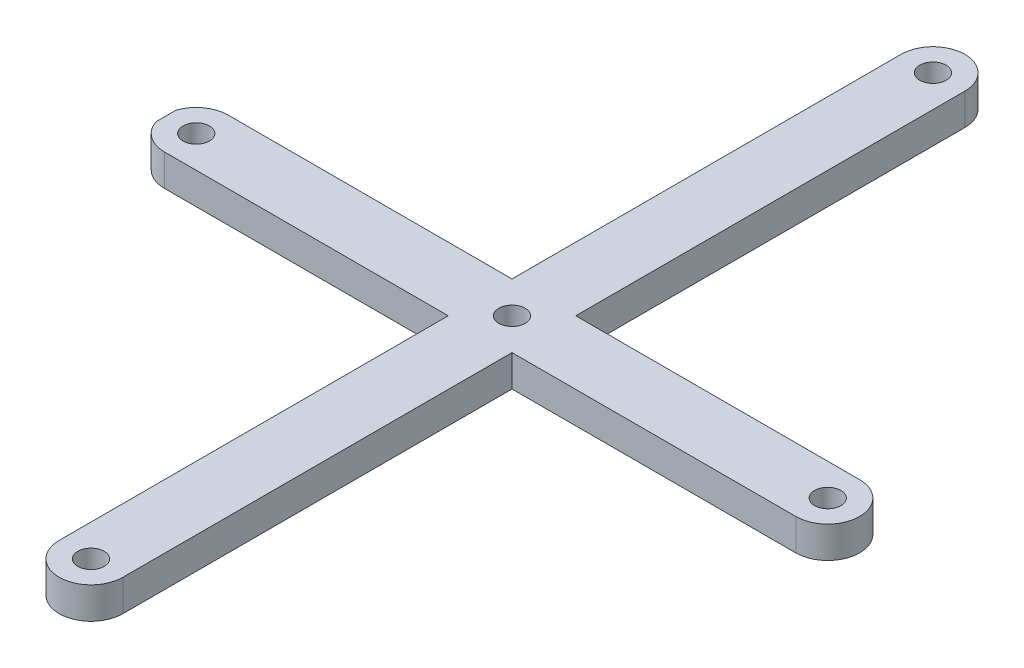
ISO-10303-21;
HEADER;
FILE_DESCRIPTION(('STEP AP214'),'2;1');
FILE_NAME('part.step','',(''),(''),'','','');
FILE_SCHEMA(('AUTOMOTIVE_DESIGN { 1 0 10303 214 1 1 1 1 }'));
ENDSEC;
DATA;
#1=APPLICATION_CONTEXT('core data for automotive mechanical design processes');
#2=APPLICATION_PROTOCOL_DEFINITION('international standard','automotive_design',2000,#1);
#3=PRODUCT_CONTEXT('',#1,'mechanical');
#4=PRODUCT('Part','Part','',(#3));
#5=PRODUCT_RELATED_PRODUCT_CATEGORY('part','',(#4));
#6=PRODUCT_DEFINITION_FORMATION('','',#4);
#7=PRODUCT_DEFINITION_CONTEXT('part definition',#1,'design');
#8=PRODUCT_DEFINITION('design','',#6,#7);
#9=PRODUCT_DEFINITION_SHAPE('','',#8);
#10=(LENGTH_UNIT() NAMED_UNIT(*) SI_UNIT(.MILLI.,.METRE.));
#11=(NAMED_UNIT(*) PLANE_ANGLE_UNIT() SI_UNIT($,.RADIAN.));
#12=(NAMED_UNIT(*) SI_UNIT($,.STERADIAN.) SOLID_ANGLE_UNIT());
#13=UNCERTAINTY_MEASURE_WITH_UNIT(LENGTH_MEASURE(1.E-05),#10,'distance_accuracy_value','');
#14=(GEOMETRIC_REPRESENTATION_CONTEXT(3) GLOBAL_UNCERTAINTY_ASSIGNED_CONTEXT((#13)) GLOBAL_UNIT_ASSIGNED_CONTEXT((#10,
#11,#12)) REPRESENTATION_CONTEXT('',''));
#15=CARTESIAN_POINT('',(0.,0.,0.));
#16=DIRECTION('',(0.,0.,1.));
#17=DIRECTION('',(1.,0.,0.));
#18=AXIS2_PLACEMENT_3D('',#15,#16,#17);
#19=CARTESIAN_POINT('',(0.,0.6,-3.42424242424242));
#20=DIRECTION('',(0.,0.,1.));
#21=DIRECTION('',(1.,0.,0.));
#22=AXIS2_PLACEMENT_3D('',#19,#20,#21);
#23=PLANE('',#22);
#24=DIRECTION('',(-1.,0.,0.));
#25=VECTOR('',#24,1.);
#26=CARTESIAN_POINT('',(0.,0.,-3.42424242424242));
#27=LINE('',#26,#25);
#28=CARTESIAN_POINT('',(7.84848484848485,0.,-3.42424242424242));
#29=VERTEX_POINT('',#28);
#30=CARTESIAN_POINT('',(2.45454545454545,0.,-3.42424242424242));
#31=VERTEX_POINT('',#30);
#32=EDGE_CURVE('E197',#29,#31,#27,.T.);
#33=ORIENTED_EDGE('',*,*,#32,.T.);
#34=DIRECTION('',(0.,-1.,0.));
#35=VECTOR('',#34,1.);
#36=CARTESIAN_POINT('',(2.45454545454545,0.6,-3.42424242424242));
#37=LINE('',#36,#35);
#38=CARTESIAN_POINT('',(2.45454545454545,0.6,-3.42424242424242));
#39=VERTEX_POINT('',#38);
#40=EDGE_CURVE('E11',#39,#31,#37,.T.);
#41=ORIENTED_EDGE('',*,*,#40,.F.);
#42=DIRECTION('',(-1.,0.,0.));
#43=VECTOR('',#42,1.);
#44=CARTESIAN_POINT('',(0.,0.6,-3.42424242424242));
#45=LINE('',#44,#43);
#46=CARTESIAN_POINT('',(7.84848484848485,0.6,-3.42424242424242));
#47=VERTEX_POINT('',#46);
#48=EDGE_CURVE('E115',#47,#39,#45,.T.);
#49=ORIENTED_EDGE('',*,*,#48,.F.);
#50=DIRECTION('',(0.,-1.,0.));
#51=VECTOR('',#50,1.);
#52=CARTESIAN_POINT('',(7.84848484848485,0.6,-3.42424242424242));
#53=LINE('',#52,#51);
#54=EDGE_CURVE('E59',#47,#29,#53,.T.);
#55=ORIENTED_EDGE('',*,*,#54,.T.);
#56=EDGE_LOOP('',(#33,#41,#49,#55));
#57=FACE_BOUND('',#56,.T.);
#58=ADVANCED_FACE('F41',(#57),#23,.F.);
#59=CARTESIAN_POINT('',(2.45454545454545,0.6,0.));
#60=DIRECTION('',(1.,0.,0.));
#61=DIRECTION('',(0.,0.,-1.));
#62=AXIS2_PLACEMENT_3D('',#59,#60,#61);
#63=PLANE('',#62);
#64=DIRECTION('',(0.,0.,1.));
#65=VECTOR('',#64,1.);
#66=CARTESIAN_POINT('',(2.45454545454545,0.,0.));
#67=LINE('',#66,#65);
#68=CARTESIAN_POINT('',(2.45454545454545,0.,-10.8181818181818));
#69=VERTEX_POINT('',#68);
#70=EDGE_CURVE('E200',#69,#31,#67,.T.);
#71=ORIENTED_EDGE('',*,*,#70,.F.);
#72=DIRECTION('',(0.,-1.,0.));
#73=VECTOR('',#72,1.);
#74=CARTESIAN_POINT('',(2.45454545454545,0.6,-10.8181818181818));
#75=LINE('',#74,#73);
#76=CARTESIAN_POINT('',(2.45454545454545,0.6,-10.8181818181818));
#77=VERTEX_POINT('',#76);
#78=EDGE_CURVE('E51',#77,#69,#75,.T.);
#79=ORIENTED_EDGE('',*,*,#78,.F.);
#80=DIRECTION('',(0.,0.,1.));
#81=VECTOR('',#80,1.);
#82=CARTESIAN_POINT('',(2.45454545454545,0.6,0.));
#83=LINE('',#82,#81);
#84=EDGE_CURVE('E312',#77,#39,#83,.T.);
#85=ORIENTED_EDGE('',*,*,#84,.T.);
#86=ORIENTED_EDGE('',*,*,#40,.T.);
#87=EDGE_LOOP('',(#71,#79,#85,#86));
#88=FACE_BOUND('',#87,.T.);
#89=ADVANCED_FACE('F43',(#88),#63,.T.);
#90=CARTESIAN_POINT('',(1.84848484848485,0.6,-10.8181818181818));
#91=DIRECTION('',(0.,-1.,0.));
#92=DIRECTION('',(0.,0.,-1.));
#93=AXIS2_PLACEMENT_3D('',#90,#91,#92);
#94=CYLINDRICAL_SURFACE('',#93,0.606060606060602);
#95=CARTESIAN_POINT('',(1.84848484848485,0.,-10.8181818181818));
#96=DIRECTION('',(0.,1.,0.));
#97=DIRECTION('',(0.,0.,1.));
#98=AXIS2_PLACEMENT_3D('',#95,#96,#97);
#99=CIRCLE('',#98,0.606060606060602);
#100=CARTESIAN_POINT('',(1.24242424242425,0.,-10.8181818181818));
#101=VERTEX_POINT('',#100);
#102=EDGE_CURVE('E206',#101,#69,#99,.F.);
#103=ORIENTED_EDGE('',*,*,#102,.F.);
#104=DIRECTION('',(0.,-1.,0.));
#105=VECTOR('',#104,1.);
#106=CARTESIAN_POINT('',(1.24242424242425,0.6,-10.8181818181818));
#107=LINE('',#106,#105);
#108=CARTESIAN_POINT('',(1.24242424242425,0.6,-10.8181818181818));
#109=VERTEX_POINT('',#108);
#110=EDGE_CURVE('E288',#109,#101,#107,.T.);
#111=ORIENTED_EDGE('',*,*,#110,.F.);
#112=CARTESIAN_POINT('',(1.84848484848485,0.6,-10.8181818181818));
#113=DIRECTION('',(0.,1.,0.));
#114=DIRECTION('',(0.,0.,1.));
#115=AXIS2_PLACEMENT_3D('',#112,#113,#114);
#116=CIRCLE('',#115,0.606060606060602);
#117=EDGE_CURVE('E297',#109,#77,#116,.F.);
#118=ORIENTED_EDGE('',*,*,#117,.T.);
#119=ORIENTED_EDGE('',*,*,#78,.T.);
#120=EDGE_LOOP('',(#103,#111,#118,#119));
#121=FACE_BOUND('',#120,.T.);
#122=ADVANCED_FACE('F295',(#121),#94,.T.);
#123=CARTESIAN_POINT('',(1.24242424242425,0.6,0.));
#124=DIRECTION('',(-1.,0.,0.));
#125=DIRECTION('',(0.,0.,1.));
#126=AXIS2_PLACEMENT_3D('',#123,#124,#125);
#127=PLANE('',#126);
#128=DIRECTION('',(0.,0.,-1.));
#129=VECTOR('',#128,1.);
#130=CARTESIAN_POINT('',(1.24242424242425,0.,0.));
#131=LINE('',#130,#129);
#132=CARTESIAN_POINT('',(1.24242424242425,0.,-3.42424242424242));
#133=VERTEX_POINT('',#132);
#134=EDGE_CURVE('E210',#133,#101,#131,.T.);
#135=ORIENTED_EDGE('',*,*,#134,.F.);
#136=DIRECTION('',(0.,-1.,0.));
#137=VECTOR('',#136,1.);
#138=CARTESIAN_POINT('',(1.24242424242425,0.6,-3.42424242424242));
#139=LINE('',#138,#137);
#140=CARTESIAN_POINT('',(1.24242424242425,0.6,-3.42424242424242));
#141=VERTEX_POINT('',#140);
#142=EDGE_CURVE('E285',#141,#133,#139,.T.);
#143=ORIENTED_EDGE('',*,*,#142,.F.);
#144=DIRECTION('',(0.,0.,-1.));
#145=VECTOR('',#144,1.);
#146=CARTESIAN_POINT('',(1.24242424242425,0.6,0.));
#147=LINE('',#146,#145);
#148=EDGE_CURVE('E311',#141,#109,#147,.T.);
#149=ORIENTED_EDGE('',*,*,#148,.T.);
#150=ORIENTED_EDGE('',*,*,#110,.T.);
#151=EDGE_LOOP('',(#135,#143,#149,#150));
#152=FACE_BOUND('',#151,.T.);
#153=ADVANCED_FACE('F307',(#152),#127,.T.);
#154=CARTESIAN_POINT('',(-4.15151515151515,0.,-3.42424242424242));
#155=VERTEX_POINT('',#154);
#156=EDGE_CURVE('E202',#133,#155,#27,.T.);
#157=ORIENTED_EDGE('',*,*,#156,.T.);
#158=DIRECTION('',(0.,-1.,0.));
#159=VECTOR('',#158,1.);
#160=CARTESIAN_POINT('',(-4.15151515151515,0.6,-3.42424242424242));
#161=LINE('',#160,#159);
#162=CARTESIAN_POINT('',(-4.15151515151515,0.6,-3.42424242424242));
#163=VERTEX_POINT('',#162);
#164=EDGE_CURVE('E281',#163,#155,#161,.T.);
#165=ORIENTED_EDGE('',*,*,#164,.F.);
#166=EDGE_CURVE('E317',#141,#163,#45,.T.);
#167=ORIENTED_EDGE('',*,*,#166,.F.);
#168=ORIENTED_EDGE('',*,*,#142,.T.);
#169=EDGE_LOOP('',(#157,#165,#167,#168));
#170=FACE_BOUND('',#169,.T.);
#171=ADVANCED_FACE('F359',(#170),#23,.F.);
#172=CARTESIAN_POINT('',(-4.15151515151515,0.6,-2.81818181818182));
#173=DIRECTION('',(0.,-1.,0.));
#174=DIRECTION('',(0.,0.,-1.));
#175=AXIS2_PLACEMENT_3D('',#172,#173,#174);
#176=CYLINDRICAL_SURFACE('',#175,0.606060606060602);
#177=CARTESIAN_POINT('',(-4.15151515151515,0.,-2.81818181818182));
#178=DIRECTION('',(0.,1.,0.));
#179=DIRECTION('',(0.,0.,1.));
#180=AXIS2_PLACEMENT_3D('',#177,#178,#179);
#181=CIRCLE('',#180,0.606060606060602);
#182=CARTESIAN_POINT('',(-4.72727272727273,0.,-3.00742418176962));
#183=VERTEX_POINT('',#182);
#184=EDGE_CURVE('E214',#155,#183,#181,.T.);
#185=ORIENTED_EDGE('',*,*,#184,.T.);
#186=DIRECTION('',(0.,-1.,0.));
#187=VECTOR('',#186,1.);
#188=CARTESIAN_POINT('',(-4.72727272727273,0.6,-3.00742418176962));
#189=LINE('',#188,#187);
#190=CARTESIAN_POINT('',(-4.72727272727273,0.6,-3.00742418176962));
#191=VERTEX_POINT('',#190);
#192=EDGE_CURVE('E277',#191,#183,#189,.T.);
#193=ORIENTED_EDGE('',*,*,#192,.F.);
#194=CARTESIAN_POINT('',(-4.15151515151515,0.6,-2.81818181818182));
#195=DIRECTION('',(0.,1.,0.));
#196=DIRECTION('',(0.,0.,1.));
#197=AXIS2_PLACEMENT_3D('',#194,#195,#196);
#198=CIRCLE('',#197,0.606060606060602);
#199=EDGE_CURVE('E322',#163,#191,#198,.T.);
#200=ORIENTED_EDGE('',*,*,#199,.F.);
#201=ORIENTED_EDGE('',*,*,#164,.T.);
#202=EDGE_LOOP('',(#185,#193,#200,#201));
#203=FACE_BOUND('',#202,.T.);
#204=ADVANCED_FACE('F366',(#203),#176,.T.);
#205=CARTESIAN_POINT('',(-4.72727272727273,0.6,0.));
#206=DIRECTION('',(1.,0.,0.));
#207=DIRECTION('',(0.,0.,-1.));
#208=AXIS2_PLACEMENT_3D('',#205,#206,#207);
#209=PLANE('',#208);
#210=DIRECTION('',(0.,0.,1.));
#211=VECTOR('',#210,1.);
#212=CARTESIAN_POINT('',(-4.72727272727273,0.,0.));
#213=LINE('',#212,#211);
#214=CARTESIAN_POINT('',(-4.72727272727273,0.,-2.62893945459401));
#215=VERTEX_POINT('',#214);
#216=EDGE_CURVE('E217',#183,#215,#213,.T.);
#217=ORIENTED_EDGE('',*,*,#216,.T.);
#218=DIRECTION('',(0.,-1.,0.));
#219=VECTOR('',#218,1.);
#220=CARTESIAN_POINT('',(-4.72727272727273,0.6,-2.62893945459401));
#221=LINE('',#220,#219);
#222=CARTESIAN_POINT('',(-4.72727272727273,0.6,-2.62893945459401));
#223=VERTEX_POINT('',#222);
#224=EDGE_CURVE('E273',#223,#215,#221,.T.);
#225=ORIENTED_EDGE('',*,*,#224,.F.);
#226=DIRECTION('',(0.,0.,1.));
#227=VECTOR('',#226,1.);
#228=CARTESIAN_POINT('',(-4.72727272727273,0.6,0.));
#229=LINE('',#228,#227);
#230=EDGE_CURVE('E325',#191,#223,#229,.T.);
#231=ORIENTED_EDGE('',*,*,#230,.F.);
#232=ORIENTED_EDGE('',*,*,#192,.T.);
#233=EDGE_LOOP('',(#217,#225,#231,#232));
#234=FACE_BOUND('',#233,.T.);
#235=ADVANCED_FACE('F372',(#234),#209,.F.);
#236=CARTESIAN_POINT('',(-4.15151515151515,0.,-2.21212121212122));
#237=VERTEX_POINT('',#236);
#238=EDGE_CURVE('E218',#215,#237,#181,.T.);
#239=ORIENTED_EDGE('',*,*,#238,.T.);
#240=DIRECTION('',(0.,-1.,0.));
#241=VECTOR('',#240,1.);
#242=CARTESIAN_POINT('',(-4.15151515151515,0.6,-2.21212121212122));
#243=LINE('',#242,#241);
#244=CARTESIAN_POINT('',(-4.15151515151515,0.6,-2.21212121212122));
#245=VERTEX_POINT('',#244);
#246=EDGE_CURVE('E270',#245,#237,#243,.T.);
#247=ORIENTED_EDGE('',*,*,#246,.F.);
#248=EDGE_CURVE('E326',#223,#245,#198,.T.);
#249=ORIENTED_EDGE('',*,*,#248,.F.);
#250=ORIENTED_EDGE('',*,*,#224,.T.);
#251=EDGE_LOOP('',(#239,#247,#249,#250));
#252=FACE_BOUND('',#251,.T.);
#253=ADVANCED_FACE('F375',(#252),#176,.T.);
#254=CARTESIAN_POINT('',(0.,0.6,-2.21212121212122));
#255=DIRECTION('',(0.,0.,1.));
#256=DIRECTION('',(1.,0.,0.));
#257=AXIS2_PLACEMENT_3D('',#254,#255,#256);
#258=PLANE('',#257);
#259=DIRECTION('',(-1.,0.,0.));
#260=VECTOR('',#259,1.);
#261=CARTESIAN_POINT('',(0.,0.,-2.21212121212122));
#262=LINE('',#261,#260);
#263=CARTESIAN_POINT('',(1.24242424242425,0.,-2.21212121212122));
#264=VERTEX_POINT('',#263);
#265=EDGE_CURVE('E221',#264,#237,#262,.T.);
#266=ORIENTED_EDGE('',*,*,#265,.F.);
#267=DIRECTION('',(0.,-1.,0.));
#268=VECTOR('',#267,1.);
#269=CARTESIAN_POINT('',(1.24242424242425,0.6,-2.21212121212122));
#270=LINE('',#269,#268);
#271=CARTESIAN_POINT('',(1.24242424242425,0.6,-2.21212121212122));
#272=VERTEX_POINT('',#271);
#273=EDGE_CURVE('E267',#272,#264,#270,.T.);
#274=ORIENTED_EDGE('',*,*,#273,.F.);
#275=DIRECTION('',(-1.,0.,0.));
#276=VECTOR('',#275,1.);
#277=CARTESIAN_POINT('',(0.,0.6,-2.21212121212122));
#278=LINE('',#277,#276);
#279=EDGE_CURVE('E329',#272,#245,#278,.T.);
#280=ORIENTED_EDGE('',*,*,#279,.T.);
#281=ORIENTED_EDGE('',*,*,#246,.T.);
#282=EDGE_LOOP('',(#266,#274,#280,#281));
#283=FACE_BOUND('',#282,.T.);
#284=ADVANCED_FACE('F513',(#283),#258,.T.);
#285=CARTESIAN_POINT('',(1.24242424242425,0.6,0.));
#286=DIRECTION('',(1.,0.,0.));
#287=DIRECTION('',(0.,0.,-1.));
#288=AXIS2_PLACEMENT_3D('',#285,#286,#287);
#289=PLANE('',#288);
#290=DIRECTION('',(0.,0.,1.));
#291=VECTOR('',#290,1.);
#292=CARTESIAN_POINT('',(1.24242424242425,0.,0.));
#293=LINE('',#292,#291);
#294=CARTESIAN_POINT('',(1.24242424242425,0.,5.18181818181818));
#295=VERTEX_POINT('',#294);
#296=EDGE_CURVE('E225',#264,#295,#293,.T.);
#297=ORIENTED_EDGE('',*,*,#296,.T.);
#298=DIRECTION('',(0.,-1.,0.));
#299=VECTOR('',#298,1.);
#300=CARTESIAN_POINT('',(1.24242424242425,0.6,5.18181818181818));
#301=LINE('',#300,#299);
#302=CARTESIAN_POINT('',(1.24242424242425,0.6,5.18181818181818));
#303=VERTEX_POINT('',#302);
#304=EDGE_CURVE('E263',#303,#295,#301,.T.);
#305=ORIENTED_EDGE('',*,*,#304,.F.);
#306=DIRECTION('',(0.,0.,1.));
#307=VECTOR('',#306,1.);
#308=CARTESIAN_POINT('',(1.24242424242425,0.6,0.));
#309=LINE('',#308,#307);
#310=EDGE_CURVE('E175',#272,#303,#309,.T.);
#311=ORIENTED_EDGE('',*,*,#310,.F.);
#312=ORIENTED_EDGE('',*,*,#273,.T.);
#313=EDGE_LOOP('',(#297,#305,#311,#312));
#314=FACE_BOUND('',#313,.T.);
#315=ADVANCED_FACE('F337',(#314),#289,.F.);
#316=CARTESIAN_POINT('',(1.84848484848485,0.6,5.18181818181818));
#317=DIRECTION('',(0.,-1.,0.));
#318=DIRECTION('',(0.,0.,-1.));
#319=AXIS2_PLACEMENT_3D('',#316,#317,#318);
#320=CYLINDRICAL_SURFACE('',#319,0.606060606060602);
#321=CARTESIAN_POINT('',(1.84848484848485,0.,5.18181818181818));
#322=DIRECTION('',(0.,1.,0.));
#323=DIRECTION('',(0.,0.,1.));
#324=AXIS2_PLACEMENT_3D('',#321,#322,#323);
#325=CIRCLE('',#324,0.606060606060602);
#326=CARTESIAN_POINT('',(2.45454545454545,0.,5.18181818181818));
#327=VERTEX_POINT('',#326);
#328=EDGE_CURVE('E228',#295,#327,#325,.T.);
#329=ORIENTED_EDGE('',*,*,#328,.T.);
#330=DIRECTION('',(0.,-1.,0.));
#331=VECTOR('',#330,1.);
#332=CARTESIAN_POINT('',(2.45454545454545,0.6,5.18181818181818));
#333=LINE('',#332,#331);
#334=CARTESIAN_POINT('',(2.45454545454545,0.6,5.18181818181818));
#335=VERTEX_POINT('',#334);
#336=EDGE_CURVE('E160',#335,#327,#333,.T.);
#337=ORIENTED_EDGE('',*,*,#336,.F.);
#338=CARTESIAN_POINT('',(1.84848484848485,0.6,5.18181818181818));
#339=DIRECTION('',(0.,1.,0.));
#340=DIRECTION('',(0.,0.,1.));
#341=AXIS2_PLACEMENT_3D('',#338,#339,#340);
#342=CIRCLE('',#341,0.606060606060602);
#343=EDGE_CURVE('E170',#303,#335,#342,.T.);
#344=ORIENTED_EDGE('',*,*,#343,.F.);
#345=ORIENTED_EDGE('',*,*,#304,.T.);
#346=EDGE_LOOP('',(#329,#337,#344,#345));
#347=FACE_BOUND('',#346,.T.);
#348=ADVANCED_FACE('F341',(#347),#320,.T.);
#349=CARTESIAN_POINT('',(2.45454545454545,0.6,0.));
#350=DIRECTION('',(1.,0.,0.));
#351=DIRECTION('',(0.,0.,-1.));
#352=AXIS2_PLACEMENT_3D('',#349,#350,#351);
#353=PLANE('',#352);
#354=DIRECTION('',(0.,0.,1.));
#355=VECTOR('',#354,1.);
#356=CARTESIAN_POINT('',(2.45454545454545,0.,0.));
#357=LINE('',#356,#355);
#358=CARTESIAN_POINT('',(2.45454545454545,0.,-2.21212121212122));
#359=VERTEX_POINT('',#358);
#360=EDGE_CURVE('E156',#359,#327,#357,.T.);
#361=ORIENTED_EDGE('',*,*,#360,.F.);
#362=DIRECTION('',(0.,-1.,0.));
#363=VECTOR('',#362,1.);
#364=CARTESIAN_POINT('',(2.45454545454545,0.6,-2.21212121212122));
#365=LINE('',#364,#363);
#366=CARTESIAN_POINT('',(2.45454545454545,0.6,-2.21212121212122));
#367=VERTEX_POINT('',#366);
#368=EDGE_CURVE('E150',#367,#359,#365,.T.);
#369=ORIENTED_EDGE('',*,*,#368,.F.);
#370=DIRECTION('',(0.,0.,1.));
#371=VECTOR('',#370,1.);
#372=CARTESIAN_POINT('',(2.45454545454545,0.6,0.));
#373=LINE('',#372,#371);
#374=EDGE_CURVE('E154',#367,#335,#373,.T.);
#375=ORIENTED_EDGE('',*,*,#374,.T.);
#376=ORIENTED_EDGE('',*,*,#336,.T.);
#377=EDGE_LOOP('',(#361,#369,#375,#376));
#378=FACE_BOUND('',#377,.T.);
#379=ADVANCED_FACE('F152',(#378),#353,.T.);
#380=CARTESIAN_POINT('',(0.,0.6,-2.21212121212122));
#381=DIRECTION('',(0.,0.,-1.));
#382=DIRECTION('',(-1.,0.,0.));
#383=AXIS2_PLACEMENT_3D('',#380,#381,#382);
#384=PLANE('',#383);
#385=DIRECTION('',(1.,0.,0.));
#386=VECTOR('',#385,1.);
#387=CARTESIAN_POINT('',(0.,0.,-2.21212121212122));
#388=LINE('',#387,#386);
#389=CARTESIAN_POINT('',(7.84848484848485,0.,-2.21212121212122));
#390=VERTEX_POINT('',#389);
#391=EDGE_CURVE('E234',#359,#390,#388,.T.);
#392=ORIENTED_EDGE('',*,*,#391,.T.);
#393=DIRECTION('',(0.,-1.,0.));
#394=VECTOR('',#393,1.);
#395=CARTESIAN_POINT('',(7.84848484848485,0.6,-2.21212121212122));
#396=LINE('',#395,#394);
#397=CARTESIAN_POINT('',(7.84848484848485,0.6,-2.21212121212122));
#398=VERTEX_POINT('',#397);
#399=EDGE_CURVE('E103',#398,#390,#396,.T.);
#400=ORIENTED_EDGE('',*,*,#399,.F.);
#401=DIRECTION('',(1.,0.,0.));
#402=VECTOR('',#401,1.);
#403=CARTESIAN_POINT('',(0.,0.6,-2.21212121212122));
#404=LINE('',#403,#402);
#405=EDGE_CURVE('E162',#367,#398,#404,.T.);
#406=ORIENTED_EDGE('',*,*,#405,.F.);
#407=ORIENTED_EDGE('',*,*,#368,.T.);
#408=EDGE_LOOP('',(#392,#400,#406,#407));
#409=FACE_BOUND('',#408,.T.);
#410=ADVANCED_FACE('F163',(#409),#384,.F.);
#411=CARTESIAN_POINT('',(7.84848484848485,0.6,-2.81818181818182));
#412=DIRECTION('',(0.,-1.,0.));
#413=DIRECTION('',(0.,0.,-1.));
#414=AXIS2_PLACEMENT_3D('',#411,#412,#413);
#415=CYLINDRICAL_SURFACE('',#414,0.250000000000001);
#416=CARTESIAN_POINT('',(7.84848484848485,0.6,-2.81818181818182));
#417=DIRECTION('',(0.,1.,0.));
#418=DIRECTION('',(0.,0.,1.));
#419=AXIS2_PLACEMENT_3D('',#416,#417,#418);
#420=CIRCLE('',#419,0.250000000000001);
#421=CARTESIAN_POINT('',(7.84848484848485,0.6,-2.56818181818182));
#422=VERTEX_POINT('',#421);
#423=EDGE_CURVE('E189',#422,#422,#420,.F.);
#424=ORIENTED_EDGE('',*,*,#423,.F.);
#425=EDGE_LOOP('',(#424));
#426=FACE_BOUND('',#425,.T.);
#427=CARTESIAN_POINT('',(7.84848484848485,0.,-2.81818181818182));
#428=DIRECTION('',(0.,1.,0.));
#429=DIRECTION('',(0.,0.,1.));
#430=AXIS2_PLACEMENT_3D('',#427,#428,#429);
#431=CIRCLE('',#430,0.250000000000001);
#432=CARTESIAN_POINT('',(7.84848484848485,0.,-2.56818181818182));
#433=VERTEX_POINT('',#432);
#434=EDGE_CURVE('E249',#433,#433,#431,.F.);
#435=ORIENTED_EDGE('',*,*,#434,.T.);
#436=EDGE_LOOP('',(#435));
#437=FACE_BOUND('',#436,.T.);
#438=ADVANCED_FACE('F413',(#426,#437),#415,.F.);
#439=CARTESIAN_POINT('',(1.84848484848485,0.6,5.18181818181818));
#440=DIRECTION('',(0.,-1.,0.));
#441=DIRECTION('',(0.,0.,-1.));
#442=AXIS2_PLACEMENT_3D('',#439,#440,#441);
#443=CYLINDRICAL_SURFACE('',#442,0.25);
#444=CARTESIAN_POINT('',(1.84848484848485,0.6,5.18181818181818));
#445=DIRECTION('',(0.,1.,0.));
#446=DIRECTION('',(0.,0.,1.));
#447=AXIS2_PLACEMENT_3D('',#444,#445,#446);
#448=CIRCLE('',#447,0.25);
#449=CARTESIAN_POINT('',(1.84848484848485,0.6,5.43181818181818));
#450=VERTEX_POINT('',#449);
#451=EDGE_CURVE('E185',#450,#450,#448,.T.);
#452=ORIENTED_EDGE('',*,*,#451,.T.);
#453=EDGE_LOOP('',(#452));
#454=FACE_BOUND('',#453,.T.);
#455=CARTESIAN_POINT('',(1.84848484848485,0.,5.18181818181818));
#456=DIRECTION('',(0.,1.,0.));
#457=DIRECTION('',(0.,0.,1.));
#458=AXIS2_PLACEMENT_3D('',#455,#456,#457);
#459=CIRCLE('',#458,0.25);
#460=CARTESIAN_POINT('',(1.84848484848485,0.,5.43181818181818));
#461=VERTEX_POINT('',#460);
#462=EDGE_CURVE('E245',#461,#461,#459,.T.);
#463=ORIENTED_EDGE('',*,*,#462,.F.);
#464=EDGE_LOOP('',(#463));
#465=FACE_BOUND('',#464,.T.);
#466=ADVANCED_FACE('F353',(#454,#465),#443,.F.);
#467=CARTESIAN_POINT('',(-4.15151515151515,0.6,-2.81818181818182));
#468=DIRECTION('',(0.,-1.,0.));
#469=DIRECTION('',(0.,0.,-1.));
#470=AXIS2_PLACEMENT_3D('',#467,#468,#469);
#471=CYLINDRICAL_SURFACE('',#470,0.25);
#472=CARTESIAN_POINT('',(-4.15151515151515,0.6,-2.81818181818182));
#473=DIRECTION('',(0.,1.,0.));
#474=DIRECTION('',(0.,0.,1.));
#475=AXIS2_PLACEMENT_3D('',#472,#473,#474);
#476=CIRCLE('',#475,0.25);
#477=CARTESIAN_POINT('',(-4.15151515151515,0.6,-2.56818181818182));
#478=VERTEX_POINT('',#477);
#479=EDGE_CURVE('E181',#478,#478,#476,.T.);
#480=ORIENTED_EDGE('',*,*,#479,.T.);
#481=EDGE_LOOP('',(#480));
#482=FACE_BOUND('',#481,.T.);
#483=CARTESIAN_POINT('',(-4.15151515151515,0.,-2.81818181818182));
#484=DIRECTION('',(0.,1.,0.));
#485=DIRECTION('',(0.,0.,1.));
#486=AXIS2_PLACEMENT_3D('',#483,#484,#485);
#487=CIRCLE('',#486,0.25);
#488=CARTESIAN_POINT('',(-4.15151515151515,0.,-2.56818181818182));
#489=VERTEX_POINT('',#488);
#490=EDGE_CURVE('E241',#489,#489,#487,.T.);
#491=ORIENTED_EDGE('',*,*,#490,.F.);
#492=EDGE_LOOP('',(#491));
#493=FACE_BOUND('',#492,.T.);
#494=ADVANCED_FACE('F345',(#482,#493),#471,.F.);
#495=CARTESIAN_POINT('',(7.84848484848485,0.6,-2.81818181818182));
#496=DIRECTION('',(0.,-1.,0.));
#497=DIRECTION('',(0.,0.,-1.));
#498=AXIS2_PLACEMENT_3D('',#495,#496,#497);
#499=CYLINDRICAL_SURFACE('',#498,0.606060606060602);
#500=CARTESIAN_POINT('',(7.84848484848485,0.,-2.81818181818182));
#501=DIRECTION('',(0.,1.,0.));
#502=DIRECTION('',(0.,0.,1.));
#503=AXIS2_PLACEMENT_3D('',#500,#501,#502);
#504=CIRCLE('',#503,0.606060606060602);
#505=EDGE_CURVE('E237',#29,#390,#504,.F.);
#506=ORIENTED_EDGE('',*,*,#505,.F.);
#507=ORIENTED_EDGE('',*,*,#54,.F.);
#508=CARTESIAN_POINT('',(7.84848484848485,0.6,-2.81818181818182));
#509=DIRECTION('',(0.,1.,0.));
#510=DIRECTION('',(0.,0.,1.));
#511=AXIS2_PLACEMENT_3D('',#508,#509,#510);
#512=CIRCLE('',#511,0.606060606060602);
#513=EDGE_CURVE('E165',#47,#398,#512,.F.);
#514=ORIENTED_EDGE('',*,*,#513,.T.);
#515=ORIENTED_EDGE('',*,*,#399,.T.);
#516=EDGE_LOOP('',(#506,#507,#514,#515));
#517=FACE_BOUND('',#516,.T.);
#518=ADVANCED_FACE('F342',(#517),#499,.T.);
#519=CARTESIAN_POINT('',(1.84848484848485,0.6,-10.8181818181818));
#520=DIRECTION('',(0.,-1.,0.));
#521=DIRECTION('',(0.,0.,-1.));
#522=AXIS2_PLACEMENT_3D('',#519,#520,#521);
#523=CYLINDRICAL_SURFACE('',#522,0.25);
#524=CARTESIAN_POINT('',(1.84848484848485,0.6,-10.8181818181818));
#525=DIRECTION('',(0.,1.,0.));
#526=DIRECTION('',(0.,0.,1.));
#527=AXIS2_PLACEMENT_3D('',#524,#525,#526);
#528=CIRCLE('',#527,0.25);
#529=CARTESIAN_POINT('',(1.84848484848485,0.6,-10.5681818181818));
#530=VERTEX_POINT('',#529);
#531=EDGE_CURVE('E193',#530,#530,#528,.F.);
#532=ORIENTED_EDGE('',*,*,#531,.F.);
#533=EDGE_LOOP('',(#532));
#534=FACE_BOUND('',#533,.T.);
#535=CARTESIAN_POINT('',(1.84848484848485,0.,-10.8181818181818));
#536=DIRECTION('',(0.,1.,0.));
#537=DIRECTION('',(0.,0.,1.));
#538=AXIS2_PLACEMENT_3D('',#535,#536,#537);
#539=CIRCLE('',#538,0.25);
#540=CARTESIAN_POINT('',(1.84848484848485,0.,-10.5681818181818));
#541=VERTEX_POINT('',#540);
#542=EDGE_CURVE('E253',#541,#541,#539,.F.);
#543=ORIENTED_EDGE('',*,*,#542,.T.);
#544=EDGE_LOOP('',(#543));
#545=FACE_BOUND('',#544,.T.);
#546=ADVANCED_FACE('F344',(#534,#545),#523,.F.);
#547=CARTESIAN_POINT('',(0.,0.6,0.));
#548=DIRECTION('',(0.,1.,0.));
#549=DIRECTION('',(0.,0.,1.));
#550=AXIS2_PLACEMENT_3D('',#547,#548,#549);
#551=PLANE('',#550);
#552=CARTESIAN_POINT('',(1.84848484848485,0.6,-2.81818181818182));
#553=DIRECTION('',(0.,1.,0.));
#554=DIRECTION('',(0.,0.,1.));
#555=AXIS2_PLACEMENT_3D('',#552,#553,#554);
#556=CIRCLE('',#555,0.25);
#557=CARTESIAN_POINT('',(1.84848484848485,0.6,-2.56818181818182));
#558=VERTEX_POINT('',#557);
#559=EDGE_CURVE('E397',#558,#558,#556,.T.);
#560=ORIENTED_EDGE('',*,*,#559,.F.);
#561=EDGE_LOOP('',(#560));
#562=FACE_BOUND('',#561,.T.);
#563=ORIENTED_EDGE('',*,*,#48,.T.);
#564=ORIENTED_EDGE('',*,*,#84,.F.);
#565=ORIENTED_EDGE('',*,*,#117,.F.);
#566=ORIENTED_EDGE('',*,*,#148,.F.);
#567=ORIENTED_EDGE('',*,*,#166,.T.);
#568=ORIENTED_EDGE('',*,*,#199,.T.);
#569=ORIENTED_EDGE('',*,*,#230,.T.);
#570=ORIENTED_EDGE('',*,*,#248,.T.);
#571=ORIENTED_EDGE('',*,*,#279,.F.);
#572=ORIENTED_EDGE('',*,*,#310,.T.);
#573=ORIENTED_EDGE('',*,*,#343,.T.);
#574=ORIENTED_EDGE('',*,*,#374,.F.);
#575=ORIENTED_EDGE('',*,*,#405,.T.);
#576=ORIENTED_EDGE('',*,*,#513,.F.);
#577=EDGE_LOOP('',(#563,#564,#565,#566,#567,#568,#569,#570,#571,#572,#573,#574,#575,#576));
#578=FACE_BOUND('',#577,.T.);
#579=ORIENTED_EDGE('',*,*,#479,.F.);
#580=EDGE_LOOP('',(#579));
#581=FACE_BOUND('',#580,.T.);
#582=ORIENTED_EDGE('',*,*,#451,.F.);
#583=EDGE_LOOP('',(#582));
#584=FACE_BOUND('',#583,.T.);
#585=ORIENTED_EDGE('',*,*,#423,.T.);
#586=EDGE_LOOP('',(#585));
#587=FACE_BOUND('',#586,.T.);
#588=ORIENTED_EDGE('',*,*,#531,.T.);
#589=EDGE_LOOP('',(#588));
#590=FACE_BOUND('',#589,.T.);
#591=ADVANCED_FACE('F167',(#562,#578,#581,#584,#587,#590),#551,.T.);
#592=CARTESIAN_POINT('',(0.,0.,0.));
#593=DIRECTION('',(0.,1.,0.));
#594=DIRECTION('',(0.,0.,1.));
#595=AXIS2_PLACEMENT_3D('',#592,#593,#594);
#596=PLANE('',#595);
#597=CARTESIAN_POINT('',(1.84848484848485,0.,-2.81818181818182));
#598=DIRECTION('',(0.,1.,0.));
#599=DIRECTION('',(0.,0.,1.));
#600=AXIS2_PLACEMENT_3D('',#597,#598,#599);
#601=CIRCLE('',#600,0.25);
#602=CARTESIAN_POINT('',(1.84848484848485,0.,-2.56818181818182));
#603=VERTEX_POINT('',#602);
#604=EDGE_CURVE('E201',#603,#603,#601,.T.);
#605=ORIENTED_EDGE('',*,*,#604,.T.);
#606=EDGE_LOOP('',(#605));
#607=FACE_BOUND('',#606,.T.);
#608=ORIENTED_EDGE('',*,*,#32,.F.);
#609=ORIENTED_EDGE('',*,*,#505,.T.);
#610=ORIENTED_EDGE('',*,*,#391,.F.);
#611=ORIENTED_EDGE('',*,*,#360,.T.);
#612=ORIENTED_EDGE('',*,*,#328,.F.);
#613=ORIENTED_EDGE('',*,*,#296,.F.);
#614=ORIENTED_EDGE('',*,*,#265,.T.);
#615=ORIENTED_EDGE('',*,*,#238,.F.);
#616=ORIENTED_EDGE('',*,*,#216,.F.);
#617=ORIENTED_EDGE('',*,*,#184,.F.);
#618=ORIENTED_EDGE('',*,*,#156,.F.);
#619=ORIENTED_EDGE('',*,*,#134,.T.);
#620=ORIENTED_EDGE('',*,*,#102,.T.);
#621=ORIENTED_EDGE('',*,*,#70,.T.);
#622=EDGE_LOOP('',(#608,#609,#610,#611,#612,#613,#614,#615,#616,#617,#618,#619,#620,#621));
#623=FACE_BOUND('',#622,.T.);
#624=ORIENTED_EDGE('',*,*,#490,.T.);
#625=EDGE_LOOP('',(#624));
#626=FACE_BOUND('',#625,.T.);
#627=ORIENTED_EDGE('',*,*,#462,.T.);
#628=EDGE_LOOP('',(#627));
#629=FACE_BOUND('',#628,.T.);
#630=ORIENTED_EDGE('',*,*,#434,.F.);
#631=EDGE_LOOP('',(#630));
#632=FACE_BOUND('',#631,.T.);
#633=ORIENTED_EDGE('',*,*,#542,.F.);
#634=EDGE_LOOP('',(#633));
#635=FACE_BOUND('',#634,.T.);
#636=ADVANCED_FACE('F301',(#607,#623,#626,#629,#632,#635),#596,.F.);
#637=CARTESIAN_POINT('',(1.84848484848485,0.,-2.81818181818182));
#638=DIRECTION('',(0.,1.,0.));
#639=DIRECTION('',(0.,0.,1.));
#640=AXIS2_PLACEMENT_3D('',#637,#638,#639);
#641=CYLINDRICAL_SURFACE('',#640,0.25);
#642=ORIENTED_EDGE('',*,*,#604,.F.);
#643=EDGE_LOOP('',(#642));
#644=FACE_BOUND('',#643,.T.);
#645=ORIENTED_EDGE('',*,*,#559,.T.);
#646=EDGE_LOOP('',(#645));
#647=FACE_BOUND('',#646,.T.);
#648=ADVANCED_FACE('F402',(#644,#647),#641,.F.);
#649=CLOSED_SHELL('',(#58,#89,#122,#153,#171,#204,#235,#253,#284,#315,#348,#379,#410,#438,#466,
#494,#518,#546,#591,#636,#648));
#650=MANIFOLD_SOLID_BREP('B2',#649);
#651=ADVANCED_BREP_SHAPE_REPRESENTATION('',(#18,#650),#14);
#652=SHAPE_DEFINITION_REPRESENTATION(#9,#651);
ENDSEC;
END-ISO-10303-21;
